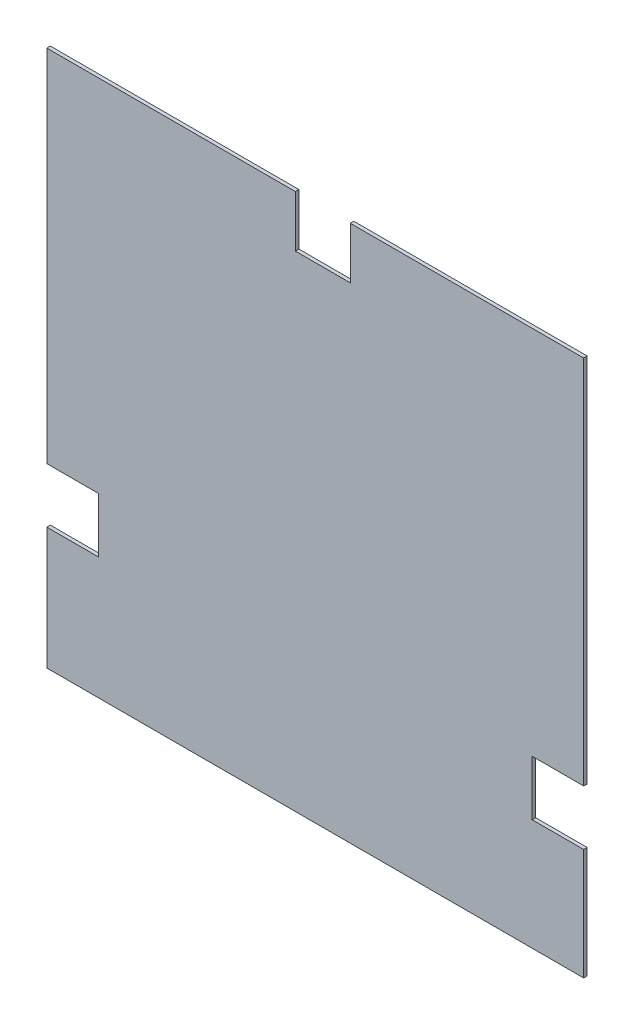
ISO-10303-21;
HEADER;
FILE_DESCRIPTION(('STEP AP214'),'2;1');
FILE_NAME('part.step','',(''),(''),'','','');
FILE_SCHEMA(('AUTOMOTIVE_DESIGN { 1 0 10303 214 1 1 1 1 }'));
ENDSEC;
DATA;
#1=APPLICATION_CONTEXT('core data for automotive mechanical design processes');
#2=APPLICATION_PROTOCOL_DEFINITION('international standard','automotive_design',2000,#1);
#3=PRODUCT_CONTEXT('',#1,'mechanical');
#4=PRODUCT('Part','Part','',(#3));
#5=PRODUCT_RELATED_PRODUCT_CATEGORY('part','',(#4));
#6=PRODUCT_DEFINITION_FORMATION('','',#4);
#7=PRODUCT_DEFINITION_CONTEXT('part definition',#1,'design');
#8=PRODUCT_DEFINITION('design','',#6,#7);
#9=PRODUCT_DEFINITION_SHAPE('','',#8);
#10=(LENGTH_UNIT() NAMED_UNIT(*) SI_UNIT(.MILLI.,.METRE.));
#11=(NAMED_UNIT(*) PLANE_ANGLE_UNIT() SI_UNIT($,.RADIAN.));
#12=(NAMED_UNIT(*) SI_UNIT($,.STERADIAN.) SOLID_ANGLE_UNIT());
#13=UNCERTAINTY_MEASURE_WITH_UNIT(LENGTH_MEASURE(1.E-05),#10,'distance_accuracy_value','');
#14=(GEOMETRIC_REPRESENTATION_CONTEXT(3) GLOBAL_UNCERTAINTY_ASSIGNED_CONTEXT((#13)) GLOBAL_UNIT_ASSIGNED_CONTEXT((#10,
#11,#12)) REPRESENTATION_CONTEXT('',''));
#15=CARTESIAN_POINT('',(0.,0.,0.));
#16=DIRECTION('',(0.,0.,1.));
#17=DIRECTION('',(1.,0.,0.));
#18=AXIS2_PLACEMENT_3D('',#15,#16,#17);
#19=CARTESIAN_POINT('',(-9.99999999999999,503.,-3.));
#20=DIRECTION('',(1.,0.,0.));
#21=DIRECTION('',(0.,1.,0.));
#22=AXIS2_PLACEMENT_3D('',#19,#20,#21);
#23=PLANE('',#22);
#24=DIRECTION('',(0.,1.,0.));
#25=VECTOR('',#24,1.);
#26=CARTESIAN_POINT('',(-9.99999999999999,503.,0.));
#27=LINE('',#26,#25);
#28=CARTESIAN_POINT('',(-10.0000000000026,185.449963394935,0.));
#29=VERTEX_POINT('',#28);
#30=CARTESIAN_POINT('',(-9.99999999999999,503.,0.));
#31=VERTEX_POINT('',#30);
#32=EDGE_CURVE('E190',#29,#31,#27,.T.);
#33=ORIENTED_EDGE('',*,*,#32,.F.);
#34=DIRECTION('',(0.,0.,1.));
#35=VECTOR('',#34,1.);
#36=CARTESIAN_POINT('',(-10.0000000000026,185.449963394935,-3.));
#37=LINE('',#36,#35);
#38=CARTESIAN_POINT('',(-10.0000000000026,185.449963394935,-3.));
#39=VERTEX_POINT('',#38);
#40=EDGE_CURVE('E11',#39,#29,#37,.T.);
#41=ORIENTED_EDGE('',*,*,#40,.F.);
#42=DIRECTION('',(0.,1.,0.));
#43=VECTOR('',#42,1.);
#44=CARTESIAN_POINT('',(-9.99999999999999,503.,-3.));
#45=LINE('',#44,#43);
#46=CARTESIAN_POINT('',(-9.99999999999999,503.,-3.));
#47=VERTEX_POINT('',#46);
#48=EDGE_CURVE('E250',#39,#47,#45,.T.);
#49=ORIENTED_EDGE('',*,*,#48,.T.);
#50=DIRECTION('',(0.,0.,1.));
#51=VECTOR('',#50,1.);
#52=CARTESIAN_POINT('',(-9.99999999999999,503.,-3.));
#53=LINE('',#52,#51);
#54=EDGE_CURVE('E42',#47,#31,#53,.T.);
#55=ORIENTED_EDGE('',*,*,#54,.T.);
#56=EDGE_LOOP('',(#33,#41,#49,#55));
#57=FACE_BOUND('',#56,.T.);
#58=ADVANCED_FACE('F39',(#57),#23,.T.);
#59=CARTESIAN_POINT('',(-54.1805080827896,185.449963394935,-3.));
#60=DIRECTION('',(0.,-1.,0.));
#61=DIRECTION('',(1.,0.,0.));
#62=AXIS2_PLACEMENT_3D('',#59,#60,#61);
#63=PLANE('',#62);
#64=DIRECTION('',(1.,0.,0.));
#65=VECTOR('',#64,1.);
#66=CARTESIAN_POINT('',(-54.1805080827896,185.449963394935,0.));
#67=LINE('',#66,#65);
#68=CARTESIAN_POINT('',(-54.1805080827896,185.449963394935,0.));
#69=VERTEX_POINT('',#68);
#70=EDGE_CURVE('E247',#69,#29,#67,.T.);
#71=ORIENTED_EDGE('',*,*,#70,.F.);
#72=DIRECTION('',(0.,0.,1.));
#73=VECTOR('',#72,1.);
#74=CARTESIAN_POINT('',(-54.1805080827896,185.449963394935,-3.));
#75=LINE('',#74,#73);
#76=CARTESIAN_POINT('',(-54.1805080827896,185.449963394935,-3.));
#77=VERTEX_POINT('',#76);
#78=EDGE_CURVE('E49',#77,#69,#75,.T.);
#79=ORIENTED_EDGE('',*,*,#78,.F.);
#80=DIRECTION('',(1.,0.,0.));
#81=VECTOR('',#80,1.);
#82=CARTESIAN_POINT('',(-54.1805080827896,185.449963394935,-3.));
#83=LINE('',#82,#81);
#84=EDGE_CURVE('E176',#77,#39,#83,.T.);
#85=ORIENTED_EDGE('',*,*,#84,.T.);
#86=ORIENTED_EDGE('',*,*,#40,.T.);
#87=EDGE_LOOP('',(#71,#79,#85,#86));
#88=FACE_BOUND('',#87,.T.);
#89=ADVANCED_FACE('F292',(#88),#63,.T.);
#90=CARTESIAN_POINT('',(-54.1805080827895,138.349963394935,-3.));
#91=DIRECTION('',(1.,0.,0.));
#92=DIRECTION('',(0.,1.,0.));
#93=AXIS2_PLACEMENT_3D('',#90,#91,#92);
#94=PLANE('',#93);
#95=DIRECTION('',(0.,1.,0.));
#96=VECTOR('',#95,1.);
#97=CARTESIAN_POINT('',(-54.1805080827895,138.349963394935,0.));
#98=LINE('',#97,#96);
#99=CARTESIAN_POINT('',(-54.1805080827895,138.349963394935,0.));
#100=VERTEX_POINT('',#99);
#101=EDGE_CURVE('E162',#100,#69,#98,.T.);
#102=ORIENTED_EDGE('',*,*,#101,.F.);
#103=DIRECTION('',(0.,0.,1.));
#104=VECTOR('',#103,1.);
#105=CARTESIAN_POINT('',(-54.1805080827895,138.349963394935,-3.));
#106=LINE('',#105,#104);
#107=CARTESIAN_POINT('',(-54.1805080827895,138.349963394935,-3.));
#108=VERTEX_POINT('',#107);
#109=EDGE_CURVE('E157',#108,#100,#106,.T.);
#110=ORIENTED_EDGE('',*,*,#109,.F.);
#111=DIRECTION('',(0.,1.,0.));
#112=VECTOR('',#111,1.);
#113=CARTESIAN_POINT('',(-54.1805080827895,138.349963394935,-3.));
#114=LINE('',#113,#112);
#115=EDGE_CURVE('E160',#108,#77,#114,.T.);
#116=ORIENTED_EDGE('',*,*,#115,.T.);
#117=ORIENTED_EDGE('',*,*,#78,.T.);
#118=EDGE_LOOP('',(#102,#110,#116,#117));
#119=FACE_BOUND('',#118,.T.);
#120=ADVANCED_FACE('F159',(#119),#94,.T.);
#121=CARTESIAN_POINT('',(-10.0000000000025,138.349963394935,-3.));
#122=DIRECTION('',(0.,1.,0.));
#123=DIRECTION('',(-1.,0.,0.));
#124=AXIS2_PLACEMENT_3D('',#121,#122,#123);
#125=PLANE('',#124);
#126=DIRECTION('',(-1.,0.,0.));
#127=VECTOR('',#126,1.);
#128=CARTESIAN_POINT('',(-10.0000000000025,138.349963394935,0.));
#129=LINE('',#128,#127);
#130=CARTESIAN_POINT('',(-10.0000000000025,138.349963394935,0.));
#131=VERTEX_POINT('',#130);
#132=EDGE_CURVE('E242',#131,#100,#129,.T.);
#133=ORIENTED_EDGE('',*,*,#132,.F.);
#134=DIRECTION('',(0.,0.,1.));
#135=VECTOR('',#134,1.);
#136=CARTESIAN_POINT('',(-10.0000000000025,138.349963394935,-3.));
#137=LINE('',#136,#135);
#138=CARTESIAN_POINT('',(-10.0000000000025,138.349963394935,-3.));
#139=VERTEX_POINT('',#138);
#140=EDGE_CURVE('E168',#139,#131,#137,.T.);
#141=ORIENTED_EDGE('',*,*,#140,.F.);
#142=DIRECTION('',(-1.,0.,0.));
#143=VECTOR('',#142,1.);
#144=CARTESIAN_POINT('',(-10.0000000000025,138.349963394935,-3.));
#145=LINE('',#144,#143);
#146=EDGE_CURVE('E174',#139,#108,#145,.T.);
#147=ORIENTED_EDGE('',*,*,#146,.T.);
#148=ORIENTED_EDGE('',*,*,#109,.T.);
#149=EDGE_LOOP('',(#133,#141,#147,#148));
#150=FACE_BOUND('',#149,.T.);
#151=ADVANCED_FACE('F179',(#150),#125,.T.);
#152=CARTESIAN_POINT('',(-10.0000000000025,138.349963394935,-3.));
#153=DIRECTION('',(1.,0.,0.));
#154=DIRECTION('',(0.,1.,0.));
#155=AXIS2_PLACEMENT_3D('',#152,#153,#154);
#156=PLANE('',#155);
#157=DIRECTION('',(0.,1.,0.));
#158=VECTOR('',#157,1.);
#159=CARTESIAN_POINT('',(-10.0000000000025,138.349963394935,0.));
#160=LINE('',#159,#158);
#161=CARTESIAN_POINT('',(-9.99999999999994,42.9999999999999,0.));
#162=VERTEX_POINT('',#161);
#163=EDGE_CURVE('E238',#162,#131,#160,.T.);
#164=ORIENTED_EDGE('',*,*,#163,.F.);
#165=DIRECTION('',(0.,0.,1.));
#166=VECTOR('',#165,1.);
#167=CARTESIAN_POINT('',(-9.99999999999994,42.9999999999999,-3.));
#168=LINE('',#167,#166);
#169=CARTESIAN_POINT('',(-9.99999999999994,42.9999999999999,-3.));
#170=VERTEX_POINT('',#169);
#171=EDGE_CURVE('E256',#170,#162,#168,.T.);
#172=ORIENTED_EDGE('',*,*,#171,.F.);
#173=DIRECTION('',(0.,1.,0.));
#174=VECTOR('',#173,1.);
#175=CARTESIAN_POINT('',(-10.0000000000025,138.349963394935,-3.));
#176=LINE('',#175,#174);
#177=EDGE_CURVE('E181',#170,#139,#176,.T.);
#178=ORIENTED_EDGE('',*,*,#177,.T.);
#179=ORIENTED_EDGE('',*,*,#140,.T.);
#180=EDGE_LOOP('',(#164,#172,#178,#179));
#181=FACE_BOUND('',#180,.T.);
#182=ADVANCED_FACE('F305',(#181),#156,.T.);
#183=CARTESIAN_POINT('',(-9.99999999999994,42.9999999999999,-3.));
#184=DIRECTION('',(0.,-1.,0.));
#185=DIRECTION('',(1.,0.,0.));
#186=AXIS2_PLACEMENT_3D('',#183,#184,#185);
#187=PLANE('',#186);
#188=DIRECTION('',(1.,0.,0.));
#189=VECTOR('',#188,1.);
#190=CARTESIAN_POINT('',(-9.99999999999994,42.9999999999999,0.));
#191=LINE('',#190,#189);
#192=CARTESIAN_POINT('',(-470.,42.9999999999999,0.));
#193=VERTEX_POINT('',#192);
#194=EDGE_CURVE('E234',#193,#162,#191,.T.);
#195=ORIENTED_EDGE('',*,*,#194,.F.);
#196=DIRECTION('',(0.,0.,1.));
#197=VECTOR('',#196,1.);
#198=CARTESIAN_POINT('',(-470.,42.9999999999999,-3.));
#199=LINE('',#198,#197);
#200=CARTESIAN_POINT('',(-470.,42.9999999999999,-3.));
#201=VERTEX_POINT('',#200);
#202=EDGE_CURVE('E259',#201,#193,#199,.T.);
#203=ORIENTED_EDGE('',*,*,#202,.F.);
#204=DIRECTION('',(1.,0.,0.));
#205=VECTOR('',#204,1.);
#206=CARTESIAN_POINT('',(-9.99999999999994,42.9999999999999,-3.));
#207=LINE('',#206,#205);
#208=EDGE_CURVE('E184',#201,#170,#207,.T.);
#209=ORIENTED_EDGE('',*,*,#208,.T.);
#210=ORIENTED_EDGE('',*,*,#171,.T.);
#211=EDGE_LOOP('',(#195,#203,#209,#210));
#212=FACE_BOUND('',#211,.T.);
#213=ADVANCED_FACE('F308',(#212),#187,.T.);
#214=CARTESIAN_POINT('',(-470.,147.549999999999,-3.));
#215=DIRECTION('',(-1.,0.,0.));
#216=DIRECTION('',(0.,-1.,0.));
#217=AXIS2_PLACEMENT_3D('',#214,#215,#216);
#218=PLANE('',#217);
#219=DIRECTION('',(0.,-1.,0.));
#220=VECTOR('',#219,1.);
#221=CARTESIAN_POINT('',(-470.,147.549999999999,0.));
#222=LINE('',#221,#220);
#223=CARTESIAN_POINT('',(-470.,147.549999999999,0.));
#224=VERTEX_POINT('',#223);
#225=EDGE_CURVE('E230',#224,#193,#222,.T.);
#226=ORIENTED_EDGE('',*,*,#225,.F.);
#227=DIRECTION('',(0.,0.,1.));
#228=VECTOR('',#227,1.);
#229=CARTESIAN_POINT('',(-470.,147.549999999999,-3.));
#230=LINE('',#229,#228);
#231=CARTESIAN_POINT('',(-470.,147.549999999999,-3.));
#232=VERTEX_POINT('',#231);
#233=EDGE_CURVE('E262',#232,#224,#230,.T.);
#234=ORIENTED_EDGE('',*,*,#233,.F.);
#235=DIRECTION('',(0.,-1.,0.));
#236=VECTOR('',#235,1.);
#237=CARTESIAN_POINT('',(-470.,147.549999999999,-3.));
#238=LINE('',#237,#236);
#239=EDGE_CURVE('E489',#232,#201,#238,.T.);
#240=ORIENTED_EDGE('',*,*,#239,.T.);
#241=ORIENTED_EDGE('',*,*,#202,.T.);
#242=EDGE_LOOP('',(#226,#234,#240,#241));
#243=FACE_BOUND('',#242,.T.);
#244=ADVANCED_FACE('F312',(#243),#218,.T.);
#245=CARTESIAN_POINT('',(-425.819491917213,147.549999999999,-3.));
#246=DIRECTION('',(0.,1.,0.));
#247=DIRECTION('',(0.,0.,1.));
#248=AXIS2_PLACEMENT_3D('',#245,#246,#247);
#249=PLANE('',#248);
#250=DIRECTION('',(-1.,0.,0.));
#251=VECTOR('',#250,1.);
#252=CARTESIAN_POINT('',(-425.819491917213,147.549999999999,0.));
#253=LINE('',#252,#251);
#254=CARTESIAN_POINT('',(-425.819491917213,147.549999999999,0.));
#255=VERTEX_POINT('',#254);
#256=EDGE_CURVE('E226',#255,#224,#253,.T.);
#257=ORIENTED_EDGE('',*,*,#256,.F.);
#258=DIRECTION('',(0.,0.,1.));
#259=VECTOR('',#258,1.);
#260=CARTESIAN_POINT('',(-425.819491917213,147.549999999999,-3.));
#261=LINE('',#260,#259);
#262=CARTESIAN_POINT('',(-425.819491917213,147.549999999999,-3.));
#263=VERTEX_POINT('',#262);
#264=EDGE_CURVE('E265',#263,#255,#261,.T.);
#265=ORIENTED_EDGE('',*,*,#264,.F.);
#266=DIRECTION('',(-1.,0.,0.));
#267=VECTOR('',#266,1.);
#268=CARTESIAN_POINT('',(-425.819491917213,147.549999999999,-3.));
#269=LINE('',#268,#267);
#270=EDGE_CURVE('E485',#263,#232,#269,.T.);
#271=ORIENTED_EDGE('',*,*,#270,.T.);
#272=ORIENTED_EDGE('',*,*,#233,.T.);
#273=EDGE_LOOP('',(#257,#265,#271,#272));
#274=FACE_BOUND('',#273,.T.);
#275=ADVANCED_FACE('F316',(#274),#249,.T.);
#276=CARTESIAN_POINT('',(-425.819491917213,194.649999999999,-3.));
#277=DIRECTION('',(-1.,0.,0.));
#278=DIRECTION('',(0.,0.,1.));
#279=AXIS2_PLACEMENT_3D('',#276,#277,#278);
#280=PLANE('',#279);
#281=DIRECTION('',(0.,-1.,0.));
#282=VECTOR('',#281,1.);
#283=CARTESIAN_POINT('',(-425.819491917213,194.649999999999,0.));
#284=LINE('',#283,#282);
#285=CARTESIAN_POINT('',(-425.819491917213,194.649999999999,0.));
#286=VERTEX_POINT('',#285);
#287=EDGE_CURVE('E222',#286,#255,#284,.T.);
#288=ORIENTED_EDGE('',*,*,#287,.F.);
#289=DIRECTION('',(0.,0.,1.));
#290=VECTOR('',#289,1.);
#291=CARTESIAN_POINT('',(-425.819491917213,194.649999999999,-3.));
#292=LINE('',#291,#290);
#293=CARTESIAN_POINT('',(-425.819491917213,194.649999999999,-3.));
#294=VERTEX_POINT('',#293);
#295=EDGE_CURVE('E268',#294,#286,#292,.T.);
#296=ORIENTED_EDGE('',*,*,#295,.F.);
#297=DIRECTION('',(0.,-1.,0.));
#298=VECTOR('',#297,1.);
#299=CARTESIAN_POINT('',(-425.819491917213,194.649999999999,-3.));
#300=LINE('',#299,#298);
#301=EDGE_CURVE('E499',#294,#263,#300,.T.);
#302=ORIENTED_EDGE('',*,*,#301,.T.);
#303=ORIENTED_EDGE('',*,*,#264,.T.);
#304=EDGE_LOOP('',(#288,#296,#302,#303));
#305=FACE_BOUND('',#304,.T.);
#306=ADVANCED_FACE('F320',(#305),#280,.T.);
#307=CARTESIAN_POINT('',(-425.819491917213,194.649999999999,-3.));
#308=DIRECTION('',(0.,-1.,0.));
#309=DIRECTION('',(0.,0.,-1.));
#310=AXIS2_PLACEMENT_3D('',#307,#308,#309);
#311=PLANE('',#310);
#312=DIRECTION('',(1.,0.,0.));
#313=VECTOR('',#312,1.);
#314=CARTESIAN_POINT('',(-425.819491917213,194.649999999999,0.));
#315=LINE('',#314,#313);
#316=CARTESIAN_POINT('',(-470.,194.649999999999,0.));
#317=VERTEX_POINT('',#316);
#318=EDGE_CURVE('E218',#317,#286,#315,.T.);
#319=ORIENTED_EDGE('',*,*,#318,.F.);
#320=DIRECTION('',(0.,0.,1.));
#321=VECTOR('',#320,1.);
#322=CARTESIAN_POINT('',(-470.,194.649999999999,-3.));
#323=LINE('',#322,#321);
#324=CARTESIAN_POINT('',(-470.,194.649999999999,-3.));
#325=VERTEX_POINT('',#324);
#326=EDGE_CURVE('E271',#325,#317,#323,.T.);
#327=ORIENTED_EDGE('',*,*,#326,.F.);
#328=DIRECTION('',(1.,0.,0.));
#329=VECTOR('',#328,1.);
#330=CARTESIAN_POINT('',(-425.819491917213,194.649999999999,-3.));
#331=LINE('',#330,#329);
#332=EDGE_CURVE('E478',#325,#294,#331,.T.);
#333=ORIENTED_EDGE('',*,*,#332,.T.);
#334=ORIENTED_EDGE('',*,*,#295,.T.);
#335=EDGE_LOOP('',(#319,#327,#333,#334));
#336=FACE_BOUND('',#335,.T.);
#337=ADVANCED_FACE('F324',(#336),#311,.T.);
#338=CARTESIAN_POINT('',(-470.,503.,-3.));
#339=DIRECTION('',(-1.,0.,0.));
#340=DIRECTION('',(0.,-1.,0.));
#341=AXIS2_PLACEMENT_3D('',#338,#339,#340);
#342=PLANE('',#341);
#343=DIRECTION('',(0.,-1.,0.));
#344=VECTOR('',#343,1.);
#345=CARTESIAN_POINT('',(-470.,503.,0.));
#346=LINE('',#345,#344);
#347=CARTESIAN_POINT('',(-470.,503.,0.));
#348=VERTEX_POINT('',#347);
#349=EDGE_CURVE('E214',#348,#317,#346,.T.);
#350=ORIENTED_EDGE('',*,*,#349,.F.);
#351=DIRECTION('',(0.,0.,1.));
#352=VECTOR('',#351,1.);
#353=CARTESIAN_POINT('',(-470.,503.,-3.));
#354=LINE('',#353,#352);
#355=CARTESIAN_POINT('',(-470.,503.,-3.));
#356=VERTEX_POINT('',#355);
#357=EDGE_CURVE('E274',#356,#348,#354,.T.);
#358=ORIENTED_EDGE('',*,*,#357,.F.);
#359=DIRECTION('',(0.,-1.,0.));
#360=VECTOR('',#359,1.);
#361=CARTESIAN_POINT('',(-470.,503.,-3.));
#362=LINE('',#361,#360);
#363=EDGE_CURVE('E474',#356,#325,#362,.T.);
#364=ORIENTED_EDGE('',*,*,#363,.T.);
#365=ORIENTED_EDGE('',*,*,#326,.T.);
#366=EDGE_LOOP('',(#350,#358,#364,#365));
#367=FACE_BOUND('',#366,.T.);
#368=ADVANCED_FACE('F328',(#367),#342,.T.);
#369=CARTESIAN_POINT('',(-257.053752565126,503.,-3.));
#370=DIRECTION('',(0.,1.,0.));
#371=DIRECTION('',(-1.,0.,0.));
#372=AXIS2_PLACEMENT_3D('',#369,#370,#371);
#373=PLANE('',#372);
#374=DIRECTION('',(-1.,0.,0.));
#375=VECTOR('',#374,1.);
#376=CARTESIAN_POINT('',(-257.053752565126,503.,0.));
#377=LINE('',#376,#375);
#378=CARTESIAN_POINT('',(-257.053752565126,503.,0.));
#379=VERTEX_POINT('',#378);
#380=EDGE_CURVE('E210',#379,#348,#377,.T.);
#381=ORIENTED_EDGE('',*,*,#380,.F.);
#382=DIRECTION('',(0.,0.,1.));
#383=VECTOR('',#382,1.);
#384=CARTESIAN_POINT('',(-257.053752565126,503.,-3.));
#385=LINE('',#384,#383);
#386=CARTESIAN_POINT('',(-257.053752565126,503.,-3.));
#387=VERTEX_POINT('',#386);
#388=EDGE_CURVE('E277',#387,#379,#385,.T.);
#389=ORIENTED_EDGE('',*,*,#388,.F.);
#390=DIRECTION('',(-1.,0.,0.));
#391=VECTOR('',#390,1.);
#392=CARTESIAN_POINT('',(-257.053752565126,503.,-3.));
#393=LINE('',#392,#391);
#394=EDGE_CURVE('E506',#387,#356,#393,.T.);
#395=ORIENTED_EDGE('',*,*,#394,.T.);
#396=ORIENTED_EDGE('',*,*,#357,.T.);
#397=EDGE_LOOP('',(#381,#389,#395,#396));
#398=FACE_BOUND('',#397,.T.);
#399=ADVANCED_FACE('F332',(#398),#373,.T.);
#400=CARTESIAN_POINT('',(-257.053752565126,458.819491917213,-3.));
#401=DIRECTION('',(1.,0.,0.));
#402=DIRECTION('',(0.,0.,-1.));
#403=AXIS2_PLACEMENT_3D('',#400,#401,#402);
#404=PLANE('',#403);
#405=DIRECTION('',(0.,1.,0.));
#406=VECTOR('',#405,1.);
#407=CARTESIAN_POINT('',(-257.053752565126,458.819491917213,0.));
#408=LINE('',#407,#406);
#409=CARTESIAN_POINT('',(-257.053752565126,458.819491917213,0.));
#410=VERTEX_POINT('',#409);
#411=EDGE_CURVE('E206',#410,#379,#408,.T.);
#412=ORIENTED_EDGE('',*,*,#411,.F.);
#413=DIRECTION('',(0.,0.,1.));
#414=VECTOR('',#413,1.);
#415=CARTESIAN_POINT('',(-257.053752565126,458.819491917213,-3.));
#416=LINE('',#415,#414);
#417=CARTESIAN_POINT('',(-257.053752565126,458.819491917213,-3.));
#418=VERTEX_POINT('',#417);
#419=EDGE_CURVE('E280',#418,#410,#416,.T.);
#420=ORIENTED_EDGE('',*,*,#419,.F.);
#421=DIRECTION('',(0.,1.,0.));
#422=VECTOR('',#421,1.);
#423=CARTESIAN_POINT('',(-257.053752565126,458.819491917213,-3.));
#424=LINE('',#423,#422);
#425=EDGE_CURVE('E467',#418,#387,#424,.T.);
#426=ORIENTED_EDGE('',*,*,#425,.T.);
#427=ORIENTED_EDGE('',*,*,#388,.T.);
#428=EDGE_LOOP('',(#412,#420,#426,#427));
#429=FACE_BOUND('',#428,.T.);
#430=ADVANCED_FACE('F336',(#429),#404,.T.);
#431=CARTESIAN_POINT('',(-209.953752565126,458.819491917213,-3.));
#432=DIRECTION('',(0.,1.,0.));
#433=DIRECTION('',(0.,0.,1.));
#434=AXIS2_PLACEMENT_3D('',#431,#432,#433);
#435=PLANE('',#434);
#436=DIRECTION('',(-1.,0.,0.));
#437=VECTOR('',#436,1.);
#438=CARTESIAN_POINT('',(-209.953752565126,458.819491917213,0.));
#439=LINE('',#438,#437);
#440=CARTESIAN_POINT('',(-209.953752565126,458.819491917213,0.));
#441=VERTEX_POINT('',#440);
#442=EDGE_CURVE('E202',#441,#410,#439,.T.);
#443=ORIENTED_EDGE('',*,*,#442,.F.);
#444=DIRECTION('',(0.,0.,1.));
#445=VECTOR('',#444,1.);
#446=CARTESIAN_POINT('',(-209.953752565126,458.819491917213,-3.));
#447=LINE('',#446,#445);
#448=CARTESIAN_POINT('',(-209.953752565126,458.819491917213,-3.));
#449=VERTEX_POINT('',#448);
#450=EDGE_CURVE('E283',#449,#441,#447,.T.);
#451=ORIENTED_EDGE('',*,*,#450,.F.);
#452=DIRECTION('',(-1.,0.,0.));
#453=VECTOR('',#452,1.);
#454=CARTESIAN_POINT('',(-209.953752565126,458.819491917213,-3.));
#455=LINE('',#454,#453);
#456=EDGE_CURVE('E463',#449,#418,#455,.T.);
#457=ORIENTED_EDGE('',*,*,#456,.T.);
#458=ORIENTED_EDGE('',*,*,#419,.T.);
#459=EDGE_LOOP('',(#443,#451,#457,#458));
#460=FACE_BOUND('',#459,.T.);
#461=ADVANCED_FACE('F340',(#460),#435,.T.);
#462=CARTESIAN_POINT('',(-209.953752565126,458.819491917213,-3.));
#463=DIRECTION('',(-1.,0.,0.));
#464=DIRECTION('',(0.,0.,1.));
#465=AXIS2_PLACEMENT_3D('',#462,#463,#464);
#466=PLANE('',#465);
#467=DIRECTION('',(0.,-1.,0.));
#468=VECTOR('',#467,1.);
#469=CARTESIAN_POINT('',(-209.953752565126,458.819491917213,0.));
#470=LINE('',#469,#468);
#471=CARTESIAN_POINT('',(-209.953752565126,503.,0.));
#472=VERTEX_POINT('',#471);
#473=EDGE_CURVE('E198',#472,#441,#470,.T.);
#474=ORIENTED_EDGE('',*,*,#473,.F.);
#475=DIRECTION('',(0.,0.,1.));
#476=VECTOR('',#475,1.);
#477=CARTESIAN_POINT('',(-209.953752565126,503.,-3.));
#478=LINE('',#477,#476);
#479=CARTESIAN_POINT('',(-209.953752565126,503.,-3.));
#480=VERTEX_POINT('',#479);
#481=EDGE_CURVE('E285',#480,#472,#478,.T.);
#482=ORIENTED_EDGE('',*,*,#481,.F.);
#483=DIRECTION('',(0.,-1.,0.));
#484=VECTOR('',#483,1.);
#485=CARTESIAN_POINT('',(-209.953752565126,458.819491917213,-3.));
#486=LINE('',#485,#484);
#487=EDGE_CURVE('E513',#480,#449,#486,.T.);
#488=ORIENTED_EDGE('',*,*,#487,.T.);
#489=ORIENTED_EDGE('',*,*,#450,.T.);
#490=EDGE_LOOP('',(#474,#482,#488,#489));
#491=FACE_BOUND('',#490,.T.);
#492=ADVANCED_FACE('F344',(#491),#466,.T.);
#493=CARTESIAN_POINT('',(-9.99999999999999,503.,-3.));
#494=DIRECTION('',(0.,1.,0.));
#495=DIRECTION('',(-1.,0.,0.));
#496=AXIS2_PLACEMENT_3D('',#493,#494,#495);
#497=PLANE('',#496);
#498=DIRECTION('',(-1.,0.,0.));
#499=VECTOR('',#498,1.);
#500=CARTESIAN_POINT('',(-9.99999999999999,503.,0.));
#501=LINE('',#500,#499);
#502=EDGE_CURVE('E194',#31,#472,#501,.T.);
#503=ORIENTED_EDGE('',*,*,#502,.F.);
#504=ORIENTED_EDGE('',*,*,#54,.F.);
#505=DIRECTION('',(-1.,0.,0.));
#506=VECTOR('',#505,1.);
#507=CARTESIAN_POINT('',(-9.99999999999999,503.,-3.));
#508=LINE('',#507,#506);
#509=EDGE_CURVE('E516',#47,#480,#508,.T.);
#510=ORIENTED_EDGE('',*,*,#509,.T.);
#511=ORIENTED_EDGE('',*,*,#481,.T.);
#512=EDGE_LOOP('',(#503,#504,#510,#511));
#513=FACE_BOUND('',#512,.T.);
#514=ADVANCED_FACE('F289',(#513),#497,.T.);
#515=CARTESIAN_POINT('',(0.,0.,-3.));
#516=DIRECTION('',(0.,0.,1.));
#517=DIRECTION('',(1.,0.,0.));
#518=AXIS2_PLACEMENT_3D('',#515,#516,#517);
#519=PLANE('',#518);
#520=ORIENTED_EDGE('',*,*,#48,.F.);
#521=ORIENTED_EDGE('',*,*,#84,.F.);
#522=ORIENTED_EDGE('',*,*,#115,.F.);
#523=ORIENTED_EDGE('',*,*,#146,.F.);
#524=ORIENTED_EDGE('',*,*,#177,.F.);
#525=ORIENTED_EDGE('',*,*,#208,.F.);
#526=ORIENTED_EDGE('',*,*,#239,.F.);
#527=ORIENTED_EDGE('',*,*,#270,.F.);
#528=ORIENTED_EDGE('',*,*,#301,.F.);
#529=ORIENTED_EDGE('',*,*,#332,.F.);
#530=ORIENTED_EDGE('',*,*,#363,.F.);
#531=ORIENTED_EDGE('',*,*,#394,.F.);
#532=ORIENTED_EDGE('',*,*,#425,.F.);
#533=ORIENTED_EDGE('',*,*,#456,.F.);
#534=ORIENTED_EDGE('',*,*,#487,.F.);
#535=ORIENTED_EDGE('',*,*,#509,.F.);
#536=EDGE_LOOP('',(#520,#521,#522,#523,#524,#525,#526,#527,#528,#529,#530,#531,#532,#533,#534,#535));
#537=FACE_BOUND('',#536,.T.);
#538=ADVANCED_FACE('F172',(#537),#519,.F.);
#539=CARTESIAN_POINT('',(0.,0.,0.));
#540=DIRECTION('',(0.,0.,1.));
#541=DIRECTION('',(1.,0.,0.));
#542=AXIS2_PLACEMENT_3D('',#539,#540,#541);
#543=PLANE('',#542);
#544=ORIENTED_EDGE('',*,*,#32,.T.);
#545=ORIENTED_EDGE('',*,*,#502,.T.);
#546=ORIENTED_EDGE('',*,*,#473,.T.);
#547=ORIENTED_EDGE('',*,*,#442,.T.);
#548=ORIENTED_EDGE('',*,*,#411,.T.);
#549=ORIENTED_EDGE('',*,*,#380,.T.);
#550=ORIENTED_EDGE('',*,*,#349,.T.);
#551=ORIENTED_EDGE('',*,*,#318,.T.);
#552=ORIENTED_EDGE('',*,*,#287,.T.);
#553=ORIENTED_EDGE('',*,*,#256,.T.);
#554=ORIENTED_EDGE('',*,*,#225,.T.);
#555=ORIENTED_EDGE('',*,*,#194,.T.);
#556=ORIENTED_EDGE('',*,*,#163,.T.);
#557=ORIENTED_EDGE('',*,*,#132,.T.);
#558=ORIENTED_EDGE('',*,*,#101,.T.);
#559=ORIENTED_EDGE('',*,*,#70,.T.);
#560=EDGE_LOOP('',(#544,#545,#546,#547,#548,#549,#550,#551,#552,#553,#554,#555,#556,#557,#558,#559));
#561=FACE_BOUND('',#560,.T.);
#562=ADVANCED_FACE('F291',(#561),#543,.T.);
#563=CLOSED_SHELL('',(#58,#89,#120,#151,#182,#213,#244,#275,#306,#337,#368,#399,#430,#461,#492,
#514,#538,#562));
#564=MANIFOLD_SOLID_BREP('B2',#563);
#565=ADVANCED_BREP_SHAPE_REPRESENTATION('',(#18,#564),#14);
#566=SHAPE_DEFINITION_REPRESENTATION(#9,#565);
ENDSEC;
END-ISO-10303-21;
